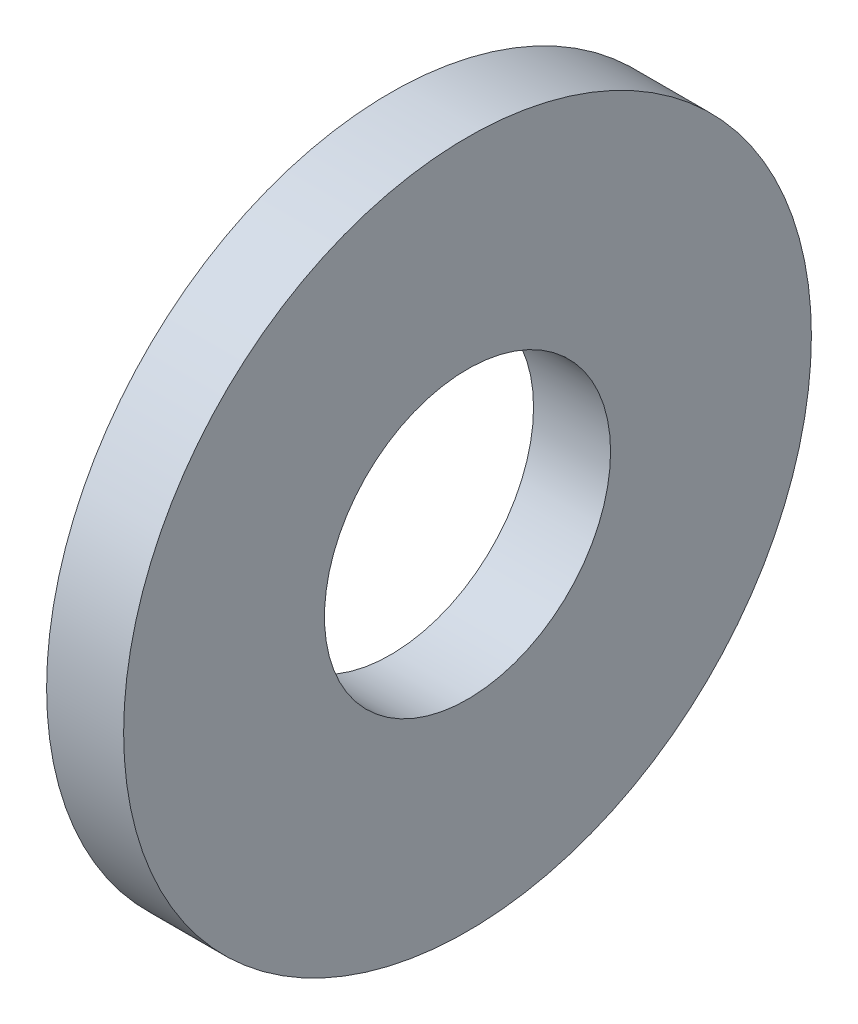
ISO-10303-21;
HEADER;
FILE_DESCRIPTION(('STEP AP214'),'2;1');
FILE_NAME('part.step','',(''),(''),'','','');
FILE_SCHEMA(('AUTOMOTIVE_DESIGN { 1 0 10303 214 1 1 1 1 }'));
ENDSEC;
DATA;
#1=APPLICATION_CONTEXT('core data for automotive mechanical design processes');
#2=APPLICATION_PROTOCOL_DEFINITION('international standard','automotive_design',2000,#1);
#3=PRODUCT_CONTEXT('',#1,'mechanical');
#4=PRODUCT('Part','Part','',(#3));
#5=PRODUCT_RELATED_PRODUCT_CATEGORY('part','',(#4));
#6=PRODUCT_DEFINITION_FORMATION('','',#4);
#7=PRODUCT_DEFINITION_CONTEXT('part definition',#1,'design');
#8=PRODUCT_DEFINITION('design','',#6,#7);
#9=PRODUCT_DEFINITION_SHAPE('','',#8);
#10=(LENGTH_UNIT() NAMED_UNIT(*) SI_UNIT(.MILLI.,.METRE.));
#11=(NAMED_UNIT(*) PLANE_ANGLE_UNIT() SI_UNIT($,.RADIAN.));
#12=(NAMED_UNIT(*) SI_UNIT($,.STERADIAN.) SOLID_ANGLE_UNIT());
#13=UNCERTAINTY_MEASURE_WITH_UNIT(LENGTH_MEASURE(1.E-05),#10,'distance_accuracy_value','');
#14=(GEOMETRIC_REPRESENTATION_CONTEXT(3) GLOBAL_UNCERTAINTY_ASSIGNED_CONTEXT((#13)) GLOBAL_UNIT_ASSIGNED_CONTEXT((#10,
#11,#12)) REPRESENTATION_CONTEXT('',''));
#15=CARTESIAN_POINT('',(0.,0.,0.));
#16=DIRECTION('',(0.,0.,1.));
#17=DIRECTION('',(1.,0.,0.));
#18=AXIS2_PLACEMENT_3D('',#15,#16,#17);
#19=CARTESIAN_POINT('',(1.778,0.,0.));
#20=DIRECTION('',(1.,0.,0.));
#21=DIRECTION('',(0.,0.,-1.));
#22=AXIS2_PLACEMENT_3D('',#19,#20,#21);
#23=PLANE('',#22);
#24=CARTESIAN_POINT('',(1.778,0.,0.));
#25=DIRECTION('',(1.,0.,0.));
#26=DIRECTION('',(0.,0.,-1.));
#27=AXIS2_PLACEMENT_3D('',#24,#25,#26);
#28=CIRCLE('',#27,7.9375);
#29=CARTESIAN_POINT('',(1.778,0.,-7.9375));
#30=VERTEX_POINT('',#29);
#31=EDGE_CURVE('E10',#30,#30,#28,.T.);
#32=ORIENTED_EDGE('',*,*,#31,.T.);
#33=EDGE_LOOP('',(#32));
#34=FACE_BOUND('',#33,.T.);
#35=CARTESIAN_POINT('',(1.778,0.,0.));
#36=DIRECTION('',(1.,0.,0.));
#37=DIRECTION('',(0.,0.,-1.));
#38=AXIS2_PLACEMENT_3D('',#35,#36,#37);
#39=CIRCLE('',#38,3.302);
#40=CARTESIAN_POINT('',(1.778,0.,-3.302));
#41=VERTEX_POINT('',#40);
#42=EDGE_CURVE('E44',#41,#41,#39,.T.);
#43=ORIENTED_EDGE('',*,*,#42,.F.);
#44=EDGE_LOOP('',(#43));
#45=FACE_BOUND('',#44,.T.);
#46=ADVANCED_FACE('F33',(#34,#45),#23,.T.);
#47=CARTESIAN_POINT('',(0.,0.,0.));
#48=DIRECTION('',(1.,0.,0.));
#49=DIRECTION('',(0.,0.,-1.));
#50=AXIS2_PLACEMENT_3D('',#47,#48,#49);
#51=PLANE('',#50);
#52=CARTESIAN_POINT('',(0.,0.,0.));
#53=DIRECTION('',(1.,0.,0.));
#54=DIRECTION('',(0.,0.,-1.));
#55=AXIS2_PLACEMENT_3D('',#52,#53,#54);
#56=CIRCLE('',#55,7.9375);
#57=CARTESIAN_POINT('',(0.,0.,-7.9375));
#58=VERTEX_POINT('',#57);
#59=EDGE_CURVE('E37',#58,#58,#56,.T.);
#60=ORIENTED_EDGE('',*,*,#59,.F.);
#61=EDGE_LOOP('',(#60));
#62=FACE_BOUND('',#61,.T.);
#63=CARTESIAN_POINT('',(0.,0.,0.));
#64=DIRECTION('',(1.,0.,0.));
#65=DIRECTION('',(0.,0.,-1.));
#66=AXIS2_PLACEMENT_3D('',#63,#64,#65);
#67=CIRCLE('',#66,3.302);
#68=CARTESIAN_POINT('',(0.,0.,-3.302));
#69=VERTEX_POINT('',#68);
#70=EDGE_CURVE('E46',#69,#69,#67,.T.);
#71=ORIENTED_EDGE('',*,*,#70,.T.);
#72=EDGE_LOOP('',(#71));
#73=FACE_BOUND('',#72,.T.);
#74=ADVANCED_FACE('F56',(#62,#73),#51,.F.);
#75=CARTESIAN_POINT('',(1.778,0.,0.));
#76=DIRECTION('',(-1.,0.,0.));
#77=DIRECTION('',(0.,0.,1.));
#78=AXIS2_PLACEMENT_3D('',#75,#76,#77);
#79=CYLINDRICAL_SURFACE('',#78,7.9375);
#80=ORIENTED_EDGE('',*,*,#31,.F.);
#81=EDGE_LOOP('',(#80));
#82=FACE_BOUND('',#81,.T.);
#83=ORIENTED_EDGE('',*,*,#59,.T.);
#84=EDGE_LOOP('',(#83));
#85=FACE_BOUND('',#84,.T.);
#86=ADVANCED_FACE('F35',(#82,#85),#79,.T.);
#87=CARTESIAN_POINT('',(1.778,0.,0.));
#88=DIRECTION('',(-1.,0.,0.));
#89=DIRECTION('',(0.,0.,1.));
#90=AXIS2_PLACEMENT_3D('',#87,#88,#89);
#91=CYLINDRICAL_SURFACE('',#90,3.302);
#92=ORIENTED_EDGE('',*,*,#42,.T.);
#93=EDGE_LOOP('',(#92));
#94=FACE_BOUND('',#93,.T.);
#95=ORIENTED_EDGE('',*,*,#70,.F.);
#96=EDGE_LOOP('',(#95));
#97=FACE_BOUND('',#96,.T.);
#98=ADVANCED_FACE('F52',(#94,#97),#91,.F.);
#99=CLOSED_SHELL('',(#46,#74,#86,#98));
#100=MANIFOLD_SOLID_BREP('B2',#99);
#101=ADVANCED_BREP_SHAPE_REPRESENTATION('',(#18,#100),#14);
#102=SHAPE_DEFINITION_REPRESENTATION(#9,#101);
ENDSEC;
END-ISO-10303-21;
